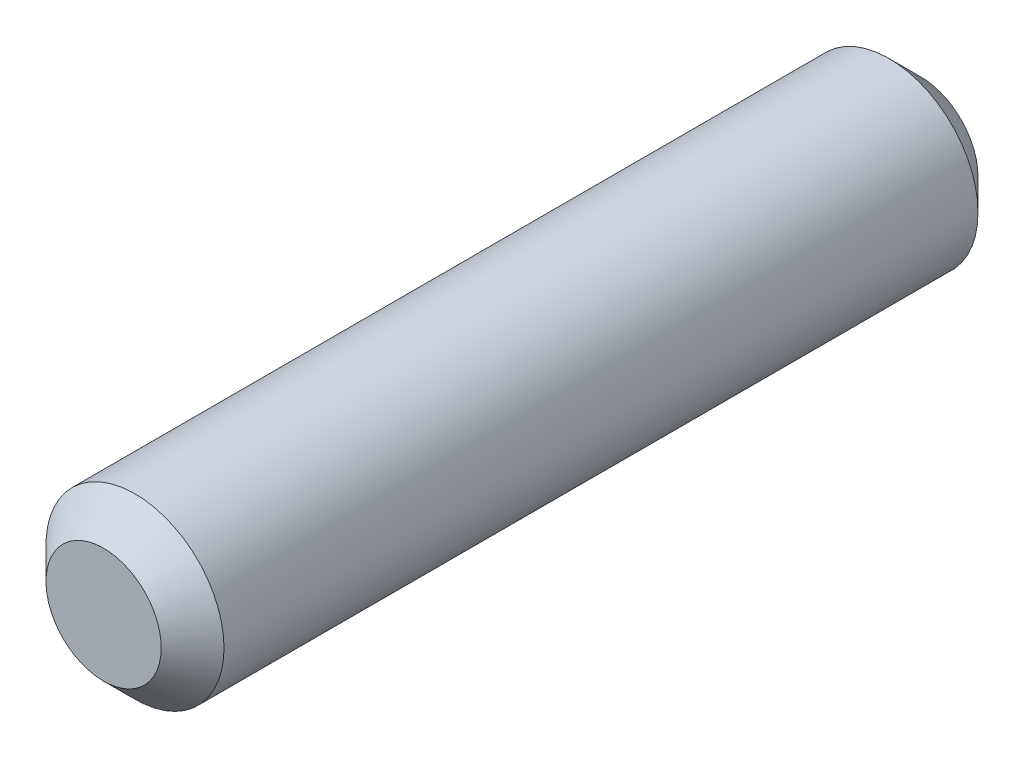
ISO-10303-21;
HEADER;
FILE_DESCRIPTION(('STEP AP214'),'2;1');
FILE_NAME('part.step','',(''),(''),'','','');
FILE_SCHEMA(('AUTOMOTIVE_DESIGN { 1 0 10303 214 1 1 1 1 }'));
ENDSEC;
DATA;
#1=APPLICATION_CONTEXT('core data for automotive mechanical design processes');
#2=APPLICATION_PROTOCOL_DEFINITION('international standard','automotive_design',2000,#1);
#3=PRODUCT_CONTEXT('',#1,'mechanical');
#4=PRODUCT('Part','Part','',(#3));
#5=PRODUCT_RELATED_PRODUCT_CATEGORY('part','',(#4));
#6=PRODUCT_DEFINITION_FORMATION('','',#4);
#7=PRODUCT_DEFINITION_CONTEXT('part definition',#1,'design');
#8=PRODUCT_DEFINITION('design','',#6,#7);
#9=PRODUCT_DEFINITION_SHAPE('','',#8);
#10=(LENGTH_UNIT() NAMED_UNIT(*) SI_UNIT(.MILLI.,.METRE.));
#11=(NAMED_UNIT(*) PLANE_ANGLE_UNIT() SI_UNIT($,.RADIAN.));
#12=(NAMED_UNIT(*) SI_UNIT($,.STERADIAN.) SOLID_ANGLE_UNIT());
#13=UNCERTAINTY_MEASURE_WITH_UNIT(LENGTH_MEASURE(1.E-05),#10,'distance_accuracy_value','');
#14=(GEOMETRIC_REPRESENTATION_CONTEXT(3) GLOBAL_UNCERTAINTY_ASSIGNED_CONTEXT((#13)) GLOBAL_UNIT_ASSIGNED_CONTEXT((#10,
#11,#12)) REPRESENTATION_CONTEXT('',''));
#15=CARTESIAN_POINT('',(0.,0.,0.));
#16=DIRECTION('',(0.,0.,1.));
#17=DIRECTION('',(1.,0.,0.));
#18=AXIS2_PLACEMENT_3D('',#15,#16,#17);
#19=CARTESIAN_POINT('',(0.,0.,39.));
#20=DIRECTION('',(0.,0.,-1.));
#21=DIRECTION('',(-1.,0.,0.));
#22=AXIS2_PLACEMENT_3D('',#19,#20,#21);
#23=CYLINDRICAL_SURFACE('',#22,8.5);
#24=CARTESIAN_POINT('',(0.,0.,-36.));
#25=DIRECTION('',(0.,0.,1.));
#26=DIRECTION('',(1.,0.,0.));
#27=AXIS2_PLACEMENT_3D('',#24,#25,#26);
#28=CIRCLE('',#27,8.5);
#29=CARTESIAN_POINT('',(8.5,0.,-36.));
#30=VERTEX_POINT('',#29);
#31=EDGE_CURVE('E25',#30,#30,#28,.T.);
#32=ORIENTED_EDGE('',*,*,#31,.T.);
#33=EDGE_LOOP('',(#32));
#34=FACE_BOUND('',#33,.T.);
#35=CARTESIAN_POINT('',(0.,0.,36.));
#36=DIRECTION('',(0.,0.,1.));
#37=DIRECTION('',(1.,0.,0.));
#38=AXIS2_PLACEMENT_3D('',#35,#36,#37);
#39=CIRCLE('',#38,8.5);
#40=CARTESIAN_POINT('',(8.5,0.,36.));
#41=VERTEX_POINT('',#40);
#42=EDGE_CURVE('E29',#41,#41,#39,.F.);
#43=ORIENTED_EDGE('',*,*,#42,.T.);
#44=EDGE_LOOP('',(#43));
#45=FACE_BOUND('',#44,.T.);
#46=ADVANCED_FACE('F14',(#34,#45),#23,.T.);
#47=CARTESIAN_POINT('',(0.,0.,39.));
#48=DIRECTION('',(0.,0.,1.));
#49=DIRECTION('',(1.,0.,0.));
#50=AXIS2_PLACEMENT_3D('',#47,#48,#49);
#51=PLANE('',#50);
#52=CARTESIAN_POINT('',(0.,0.,39.));
#53=DIRECTION('',(0.,0.,1.));
#54=DIRECTION('',(1.,0.,0.));
#55=AXIS2_PLACEMENT_3D('',#52,#53,#54);
#56=CIRCLE('',#55,5.5);
#57=CARTESIAN_POINT('',(5.5,0.,39.));
#58=VERTEX_POINT('',#57);
#59=EDGE_CURVE('E10',#58,#58,#56,.T.);
#60=ORIENTED_EDGE('',*,*,#59,.T.);
#61=EDGE_LOOP('',(#60));
#62=FACE_BOUND('',#61,.T.);
#63=ADVANCED_FACE('F47',(#62),#51,.T.);
#64=CARTESIAN_POINT('',(0.,0.,-39.));
#65=DIRECTION('',(0.,0.,1.));
#66=DIRECTION('',(1.,0.,0.));
#67=AXIS2_PLACEMENT_3D('',#64,#65,#66);
#68=PLANE('',#67);
#69=CARTESIAN_POINT('',(0.,0.,-39.));
#70=DIRECTION('',(0.,0.,1.));
#71=DIRECTION('',(1.,0.,0.));
#72=AXIS2_PLACEMENT_3D('',#69,#70,#71);
#73=CIRCLE('',#72,5.5);
#74=CARTESIAN_POINT('',(5.5,0.,-39.));
#75=VERTEX_POINT('',#74);
#76=EDGE_CURVE('E21',#75,#75,#73,.F.);
#77=ORIENTED_EDGE('',*,*,#76,.T.);
#78=EDGE_LOOP('',(#77));
#79=FACE_BOUND('',#78,.T.);
#80=ADVANCED_FACE('F44',(#79),#68,.F.);
#81=CARTESIAN_POINT('',(0.,0.,-36.));
#82=DIRECTION('',(0.,0.,1.));
#83=DIRECTION('',(1.,0.,0.));
#84=AXIS2_PLACEMENT_3D('',#81,#82,#83);
#85=CONICAL_SURFACE('',#84,8.5,0.78539816339745);
#86=ORIENTED_EDGE('',*,*,#76,.F.);
#87=EDGE_LOOP('',(#86));
#88=FACE_BOUND('',#87,.T.);
#89=ORIENTED_EDGE('',*,*,#31,.F.);
#90=EDGE_LOOP('',(#89));
#91=FACE_BOUND('',#90,.T.);
#92=ADVANCED_FACE('F38',(#88,#91),#85,.T.);
#93=CARTESIAN_POINT('',(0.,0.,39.));
#94=DIRECTION('',(0.,0.,-1.));
#95=DIRECTION('',(-1.,0.,0.));
#96=AXIS2_PLACEMENT_3D('',#93,#94,#95);
#97=CONICAL_SURFACE('',#96,5.5,0.785398163397448);
#98=ORIENTED_EDGE('',*,*,#42,.F.);
#99=EDGE_LOOP('',(#98));
#100=FACE_BOUND('',#99,.T.);
#101=ORIENTED_EDGE('',*,*,#59,.F.);
#102=EDGE_LOOP('',(#101));
#103=FACE_BOUND('',#102,.T.);
#104=ADVANCED_FACE('F16',(#100,#103),#97,.T.);
#105=CLOSED_SHELL('',(#46,#63,#80,#92,#104));
#106=MANIFOLD_SOLID_BREP('B1',#105);
#107=ADVANCED_BREP_SHAPE_REPRESENTATION('',(#18,#106),#14);
#108=SHAPE_DEFINITION_REPRESENTATION(#9,#107);
ENDSEC;
END-ISO-10303-21;
